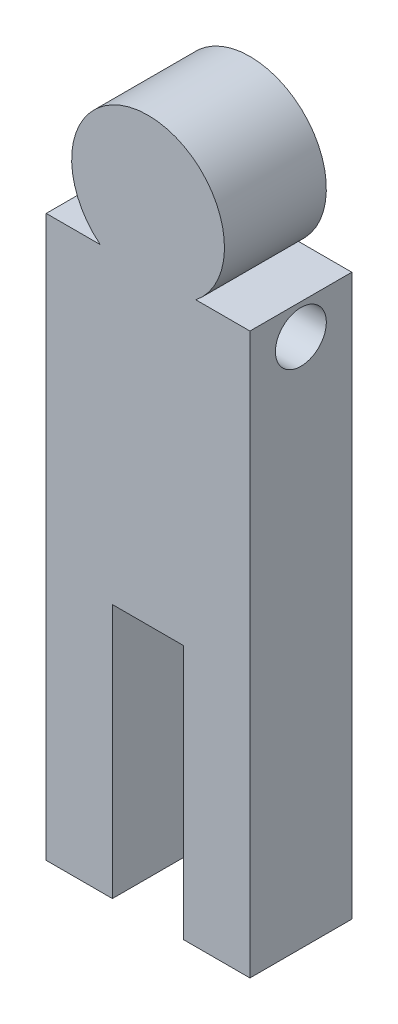
ISO-10303-21;
HEADER;
FILE_DESCRIPTION(('STEP AP214'),'2;1');
FILE_NAME('part.step','',(''),(''),'','','');
FILE_SCHEMA(('AUTOMOTIVE_DESIGN { 1 0 10303 214 1 1 1 1 }'));
ENDSEC;
DATA;
#1=APPLICATION_CONTEXT('core data for automotive mechanical design processes');
#2=APPLICATION_PROTOCOL_DEFINITION('international standard','automotive_design',2000,#1);
#3=PRODUCT_CONTEXT('',#1,'mechanical');
#4=PRODUCT('Part','Part','',(#3));
#5=PRODUCT_RELATED_PRODUCT_CATEGORY('part','',(#4));
#6=PRODUCT_DEFINITION_FORMATION('','',#4);
#7=PRODUCT_DEFINITION_CONTEXT('part definition',#1,'design');
#8=PRODUCT_DEFINITION('design','',#6,#7);
#9=PRODUCT_DEFINITION_SHAPE('','',#8);
#10=(LENGTH_UNIT() NAMED_UNIT(*) SI_UNIT(.MILLI.,.METRE.));
#11=(NAMED_UNIT(*) PLANE_ANGLE_UNIT() SI_UNIT($,.RADIAN.));
#12=(NAMED_UNIT(*) SI_UNIT($,.STERADIAN.) SOLID_ANGLE_UNIT());
#13=UNCERTAINTY_MEASURE_WITH_UNIT(LENGTH_MEASURE(1.E-05),#10,'distance_accuracy_value','');
#14=(GEOMETRIC_REPRESENTATION_CONTEXT(3) GLOBAL_UNCERTAINTY_ASSIGNED_CONTEXT((#13)) GLOBAL_UNIT_ASSIGNED_CONTEXT((#10,
#11,#12)) REPRESENTATION_CONTEXT('',''));
#15=CARTESIAN_POINT('',(0.,0.,0.));
#16=DIRECTION('',(0.,0.,1.));
#17=DIRECTION('',(1.,0.,0.));
#18=AXIS2_PLACEMENT_3D('',#15,#16,#17);
#19=CARTESIAN_POINT('',(4.69532415377732,15.,10.));
#20=DIRECTION('',(0.,-1.,0.));
#21=DIRECTION('',(0.,0.,-1.));
#22=AXIS2_PLACEMENT_3D('',#19,#20,#21);
#23=PLANE('',#22);
#24=DIRECTION('',(-1.,0.,0.));
#25=VECTOR('',#24,1.);
#26=CARTESIAN_POINT('',(4.69532415377732,15.,0.));
#27=LINE('',#26,#25);
#28=CARTESIAN_POINT('',(10.,15.,0.));
#29=VERTEX_POINT('',#28);
#30=CARTESIAN_POINT('',(4.69532415377732,15.,0.));
#31=VERTEX_POINT('',#30);
#32=EDGE_CURVE('E157',#29,#31,#27,.T.);
#33=ORIENTED_EDGE('',*,*,#32,.T.);
#34=DIRECTION('',(0.,0.,-1.));
#35=VECTOR('',#34,1.);
#36=CARTESIAN_POINT('',(4.69532415377732,15.,10.));
#37=LINE('',#36,#35);
#38=CARTESIAN_POINT('',(4.69532415377732,15.,10.));
#39=VERTEX_POINT('',#38);
#40=EDGE_CURVE('E11',#39,#31,#37,.T.);
#41=ORIENTED_EDGE('',*,*,#40,.F.);
#42=DIRECTION('',(-1.,0.,0.));
#43=VECTOR('',#42,1.);
#44=CARTESIAN_POINT('',(4.69532415377732,15.,10.));
#45=LINE('',#44,#43);
#46=CARTESIAN_POINT('',(10.,15.,10.));
#47=VERTEX_POINT('',#46);
#48=EDGE_CURVE('E188',#47,#39,#45,.T.);
#49=ORIENTED_EDGE('',*,*,#48,.F.);
#50=DIRECTION('',(0.,0.,-1.));
#51=VECTOR('',#50,1.);
#52=CARTESIAN_POINT('',(10.,15.,10.));
#53=LINE('',#52,#51);
#54=EDGE_CURVE('E153',#47,#29,#53,.T.);
#55=ORIENTED_EDGE('',*,*,#54,.T.);
#56=EDGE_LOOP('',(#33,#41,#49,#55));
#57=FACE_BOUND('',#56,.T.);
#58=ADVANCED_FACE('F43',(#57),#23,.F.);
#59=CARTESIAN_POINT('',(0.,20.8484126984127,10.));
#60=DIRECTION('',(0.,0.,-1.));
#61=DIRECTION('',(-1.,0.,0.));
#62=AXIS2_PLACEMENT_3D('',#59,#60,#61);
#63=CYLINDRICAL_SURFACE('',#62,7.5);
#64=CARTESIAN_POINT('',(0.,20.8484126984127,0.));
#65=DIRECTION('',(0.,0.,1.));
#66=DIRECTION('',(1.,0.,0.));
#67=AXIS2_PLACEMENT_3D('',#64,#65,#66);
#68=CIRCLE('',#67,7.5);
#69=CARTESIAN_POINT('',(-4.69532415377732,15.,0.));
#70=VERTEX_POINT('',#69);
#71=EDGE_CURVE('E161',#31,#70,#68,.T.);
#72=ORIENTED_EDGE('',*,*,#71,.T.);
#73=DIRECTION('',(0.,0.,-1.));
#74=VECTOR('',#73,1.);
#75=CARTESIAN_POINT('',(-4.69532415377732,15.,10.));
#76=LINE('',#75,#74);
#77=CARTESIAN_POINT('',(-4.69532415377732,15.,10.));
#78=VERTEX_POINT('',#77);
#79=EDGE_CURVE('E52',#78,#70,#76,.T.);
#80=ORIENTED_EDGE('',*,*,#79,.F.);
#81=CARTESIAN_POINT('',(0.,20.8484126984127,10.));
#82=DIRECTION('',(0.,0.,1.));
#83=DIRECTION('',(1.,0.,0.));
#84=AXIS2_PLACEMENT_3D('',#81,#82,#83);
#85=CIRCLE('',#84,7.5);
#86=EDGE_CURVE('E107',#39,#78,#85,.T.);
#87=ORIENTED_EDGE('',*,*,#86,.F.);
#88=ORIENTED_EDGE('',*,*,#40,.T.);
#89=EDGE_LOOP('',(#72,#80,#87,#88));
#90=FACE_BOUND('',#89,.T.);
#91=ADVANCED_FACE('F269',(#90),#63,.T.);
#92=CARTESIAN_POINT('',(-10.,15.,10.));
#93=DIRECTION('',(0.,-1.,0.));
#94=DIRECTION('',(0.,0.,-1.));
#95=AXIS2_PLACEMENT_3D('',#92,#93,#94);
#96=PLANE('',#95);
#97=DIRECTION('',(-1.,0.,0.));
#98=VECTOR('',#97,1.);
#99=CARTESIAN_POINT('',(-10.,15.,0.));
#100=LINE('',#99,#98);
#101=CARTESIAN_POINT('',(-10.,15.,0.));
#102=VERTEX_POINT('',#101);
#103=EDGE_CURVE('E165',#70,#102,#100,.T.);
#104=ORIENTED_EDGE('',*,*,#103,.T.);
#105=DIRECTION('',(0.,0.,-1.));
#106=VECTOR('',#105,1.);
#107=CARTESIAN_POINT('',(-10.,15.,10.));
#108=LINE('',#107,#106);
#109=CARTESIAN_POINT('',(-10.,15.,10.));
#110=VERTEX_POINT('',#109);
#111=EDGE_CURVE('E207',#110,#102,#108,.T.);
#112=ORIENTED_EDGE('',*,*,#111,.F.);
#113=DIRECTION('',(-1.,0.,0.));
#114=VECTOR('',#113,1.);
#115=CARTESIAN_POINT('',(-10.,15.,10.));
#116=LINE('',#115,#114);
#117=EDGE_CURVE('E217',#78,#110,#116,.T.);
#118=ORIENTED_EDGE('',*,*,#117,.F.);
#119=ORIENTED_EDGE('',*,*,#79,.T.);
#120=EDGE_LOOP('',(#104,#112,#118,#119));
#121=FACE_BOUND('',#120,.T.);
#122=ADVANCED_FACE('F215',(#121),#96,.F.);
#123=CARTESIAN_POINT('',(-10.,-15.,10.));
#124=DIRECTION('',(1.,0.,0.));
#125=DIRECTION('',(0.,1.,0.));
#126=AXIS2_PLACEMENT_3D('',#123,#124,#125);
#127=PLANE('',#126);
#128=CARTESIAN_POINT('',(-10.,12.,5.));
#129=DIRECTION('',(1.,0.,0.));
#130=DIRECTION('',(0.,1.,0.));
#131=AXIS2_PLACEMENT_3D('',#128,#129,#130);
#132=CIRCLE('',#131,2.5);
#133=CARTESIAN_POINT('',(-10.,14.5,5.));
#134=VERTEX_POINT('',#133);
#135=EDGE_CURVE('E162',#134,#134,#132,.T.);
#136=ORIENTED_EDGE('',*,*,#135,.T.);
#137=EDGE_LOOP('',(#136));
#138=FACE_BOUND('',#137,.T.);
#139=DIRECTION('',(0.,-1.,0.));
#140=VECTOR('',#139,1.);
#141=CARTESIAN_POINT('',(-10.,-15.,0.));
#142=LINE('',#141,#140);
#143=CARTESIAN_POINT('',(-9.99999999999999,-40.,0.));
#144=VERTEX_POINT('',#143);
#145=EDGE_CURVE('E169',#102,#144,#142,.T.);
#146=ORIENTED_EDGE('',*,*,#145,.T.);
#147=DIRECTION('',(0.,0.,-1.));
#148=VECTOR('',#147,1.);
#149=CARTESIAN_POINT('',(-9.99999999999999,-40.,10.));
#150=LINE('',#149,#148);
#151=CARTESIAN_POINT('',(-9.99999999999999,-40.,10.));
#152=VERTEX_POINT('',#151);
#153=EDGE_CURVE('E203',#152,#144,#150,.T.);
#154=ORIENTED_EDGE('',*,*,#153,.F.);
#155=DIRECTION('',(0.,-1.,0.));
#156=VECTOR('',#155,1.);
#157=CARTESIAN_POINT('',(-10.,-15.,10.));
#158=LINE('',#157,#156);
#159=EDGE_CURVE('E233',#110,#152,#158,.T.);
#160=ORIENTED_EDGE('',*,*,#159,.F.);
#161=ORIENTED_EDGE('',*,*,#111,.T.);
#162=EDGE_LOOP('',(#146,#154,#160,#161));
#163=FACE_BOUND('',#162,.T.);
#164=ADVANCED_FACE('F223',(#138,#163),#127,.F.);
#165=CARTESIAN_POINT('',(-9.99999999999999,-40.,10.));
#166=DIRECTION('',(0.,1.,0.));
#167=DIRECTION('',(0.,0.,1.));
#168=AXIS2_PLACEMENT_3D('',#165,#166,#167);
#169=PLANE('',#168);
#170=DIRECTION('',(1.,0.,0.));
#171=VECTOR('',#170,1.);
#172=CARTESIAN_POINT('',(-9.99999999999999,-40.,0.));
#173=LINE('',#172,#171);
#174=CARTESIAN_POINT('',(-3.5,-40.,0.));
#175=VERTEX_POINT('',#174);
#176=EDGE_CURVE('E172',#144,#175,#173,.T.);
#177=ORIENTED_EDGE('',*,*,#176,.T.);
#178=DIRECTION('',(0.,0.,-1.));
#179=VECTOR('',#178,1.);
#180=CARTESIAN_POINT('',(-3.5,-40.,10.));
#181=LINE('',#180,#179);
#182=CARTESIAN_POINT('',(-3.5,-40.,10.));
#183=VERTEX_POINT('',#182);
#184=EDGE_CURVE('E199',#183,#175,#181,.T.);
#185=ORIENTED_EDGE('',*,*,#184,.F.);
#186=DIRECTION('',(1.,0.,0.));
#187=VECTOR('',#186,1.);
#188=CARTESIAN_POINT('',(-9.99999999999999,-40.,10.));
#189=LINE('',#188,#187);
#190=EDGE_CURVE('E229',#152,#183,#189,.T.);
#191=ORIENTED_EDGE('',*,*,#190,.F.);
#192=ORIENTED_EDGE('',*,*,#153,.T.);
#193=EDGE_LOOP('',(#177,#185,#191,#192));
#194=FACE_BOUND('',#193,.T.);
#195=ADVANCED_FACE('F227',(#194),#169,.F.);
#196=CARTESIAN_POINT('',(-3.5,-40.,10.));
#197=DIRECTION('',(-1.,0.,0.));
#198=DIRECTION('',(0.,0.,1.));
#199=AXIS2_PLACEMENT_3D('',#196,#197,#198);
#200=PLANE('',#199);
#201=DIRECTION('',(0.,1.,0.));
#202=VECTOR('',#201,1.);
#203=CARTESIAN_POINT('',(-3.5,-40.,0.));
#204=LINE('',#203,#202);
#205=CARTESIAN_POINT('',(-3.5,-15.,0.));
#206=VERTEX_POINT('',#205);
#207=EDGE_CURVE('E175',#175,#206,#204,.T.);
#208=ORIENTED_EDGE('',*,*,#207,.T.);
#209=DIRECTION('',(0.,0.,-1.));
#210=VECTOR('',#209,1.);
#211=CARTESIAN_POINT('',(-3.5,-15.,10.));
#212=LINE('',#211,#210);
#213=CARTESIAN_POINT('',(-3.5,-15.,10.));
#214=VERTEX_POINT('',#213);
#215=EDGE_CURVE('E195',#214,#206,#212,.T.);
#216=ORIENTED_EDGE('',*,*,#215,.F.);
#217=DIRECTION('',(0.,1.,0.));
#218=VECTOR('',#217,1.);
#219=CARTESIAN_POINT('',(-3.5,-40.,10.));
#220=LINE('',#219,#218);
#221=EDGE_CURVE('E232',#183,#214,#220,.T.);
#222=ORIENTED_EDGE('',*,*,#221,.F.);
#223=ORIENTED_EDGE('',*,*,#184,.T.);
#224=EDGE_LOOP('',(#208,#216,#222,#223));
#225=FACE_BOUND('',#224,.T.);
#226=ADVANCED_FACE('F286',(#225),#200,.F.);
#227=CARTESIAN_POINT('',(-3.5,-15.,10.));
#228=DIRECTION('',(0.,1.,0.));
#229=DIRECTION('',(0.,0.,1.));
#230=AXIS2_PLACEMENT_3D('',#227,#228,#229);
#231=PLANE('',#230);
#232=DIRECTION('',(1.,0.,0.));
#233=VECTOR('',#232,1.);
#234=CARTESIAN_POINT('',(-3.5,-15.,0.));
#235=LINE('',#234,#233);
#236=CARTESIAN_POINT('',(3.5,-15.,0.));
#237=VERTEX_POINT('',#236);
#238=EDGE_CURVE('E178',#206,#237,#235,.T.);
#239=ORIENTED_EDGE('',*,*,#238,.T.);
#240=DIRECTION('',(0.,0.,-1.));
#241=VECTOR('',#240,1.);
#242=CARTESIAN_POINT('',(3.5,-15.,10.));
#243=LINE('',#242,#241);
#244=CARTESIAN_POINT('',(3.5,-15.,10.));
#245=VERTEX_POINT('',#244);
#246=EDGE_CURVE('E146',#245,#237,#243,.T.);
#247=ORIENTED_EDGE('',*,*,#246,.F.);
#248=DIRECTION('',(1.,0.,0.));
#249=VECTOR('',#248,1.);
#250=CARTESIAN_POINT('',(-3.5,-15.,10.));
#251=LINE('',#250,#249);
#252=EDGE_CURVE('E133',#214,#245,#251,.T.);
#253=ORIENTED_EDGE('',*,*,#252,.F.);
#254=ORIENTED_EDGE('',*,*,#215,.T.);
#255=EDGE_LOOP('',(#239,#247,#253,#254));
#256=FACE_BOUND('',#255,.T.);
#257=ADVANCED_FACE('F289',(#256),#231,.F.);
#258=CARTESIAN_POINT('',(3.5,-40.,10.));
#259=DIRECTION('',(1.,0.,0.));
#260=DIRECTION('',(0.,0.,-1.));
#261=AXIS2_PLACEMENT_3D('',#258,#259,#260);
#262=PLANE('',#261);
#263=DIRECTION('',(0.,-1.,0.));
#264=VECTOR('',#263,1.);
#265=CARTESIAN_POINT('',(3.5,-40.,0.));
#266=LINE('',#265,#264);
#267=CARTESIAN_POINT('',(3.5,-40.,0.));
#268=VERTEX_POINT('',#267);
#269=EDGE_CURVE('E143',#237,#268,#266,.T.);
#270=ORIENTED_EDGE('',*,*,#269,.T.);
#271=DIRECTION('',(0.,0.,-1.));
#272=VECTOR('',#271,1.);
#273=CARTESIAN_POINT('',(3.5,-40.,10.));
#274=LINE('',#273,#272);
#275=CARTESIAN_POINT('',(3.5,-40.,10.));
#276=VERTEX_POINT('',#275);
#277=EDGE_CURVE('E140',#276,#268,#274,.T.);
#278=ORIENTED_EDGE('',*,*,#277,.F.);
#279=DIRECTION('',(0.,-1.,0.));
#280=VECTOR('',#279,1.);
#281=CARTESIAN_POINT('',(3.5,-40.,10.));
#282=LINE('',#281,#280);
#283=EDGE_CURVE('E126',#245,#276,#282,.T.);
#284=ORIENTED_EDGE('',*,*,#283,.F.);
#285=ORIENTED_EDGE('',*,*,#246,.T.);
#286=EDGE_LOOP('',(#270,#278,#284,#285));
#287=FACE_BOUND('',#286,.T.);
#288=ADVANCED_FACE('F141',(#287),#262,.F.);
#289=CARTESIAN_POINT('',(10.,-40.,10.));
#290=DIRECTION('',(0.,1.,0.));
#291=DIRECTION('',(0.,0.,1.));
#292=AXIS2_PLACEMENT_3D('',#289,#290,#291);
#293=PLANE('',#292);
#294=DIRECTION('',(1.,0.,0.));
#295=VECTOR('',#294,1.);
#296=CARTESIAN_POINT('',(10.,-40.,0.));
#297=LINE('',#296,#295);
#298=CARTESIAN_POINT('',(10.,-40.,0.));
#299=VERTEX_POINT('',#298);
#300=EDGE_CURVE('E183',#268,#299,#297,.T.);
#301=ORIENTED_EDGE('',*,*,#300,.T.);
#302=DIRECTION('',(0.,0.,-1.));
#303=VECTOR('',#302,1.);
#304=CARTESIAN_POINT('',(10.,-40.,10.));
#305=LINE('',#304,#303);
#306=CARTESIAN_POINT('',(10.,-40.,10.));
#307=VERTEX_POINT('',#306);
#308=EDGE_CURVE('E147',#307,#299,#305,.T.);
#309=ORIENTED_EDGE('',*,*,#308,.F.);
#310=DIRECTION('',(1.,0.,0.));
#311=VECTOR('',#310,1.);
#312=CARTESIAN_POINT('',(10.,-40.,10.));
#313=LINE('',#312,#311);
#314=EDGE_CURVE('E130',#276,#307,#313,.T.);
#315=ORIENTED_EDGE('',*,*,#314,.F.);
#316=ORIENTED_EDGE('',*,*,#277,.T.);
#317=EDGE_LOOP('',(#301,#309,#315,#316));
#318=FACE_BOUND('',#317,.T.);
#319=ADVANCED_FACE('F149',(#318),#293,.F.);
#320=CARTESIAN_POINT('',(10.,-15.,10.));
#321=DIRECTION('',(-1.,0.,0.));
#322=DIRECTION('',(0.,0.,1.));
#323=AXIS2_PLACEMENT_3D('',#320,#321,#322);
#324=PLANE('',#323);
#325=CARTESIAN_POINT('',(10.,12.,5.));
#326=DIRECTION('',(1.,0.,0.));
#327=DIRECTION('',(0.,0.,-1.));
#328=AXIS2_PLACEMENT_3D('',#325,#326,#327);
#329=CIRCLE('',#328,2.5);
#330=CARTESIAN_POINT('',(10.,12.,2.5));
#331=VERTEX_POINT('',#330);
#332=EDGE_CURVE('E250',#331,#331,#329,.T.);
#333=ORIENTED_EDGE('',*,*,#332,.F.);
#334=EDGE_LOOP('',(#333));
#335=FACE_BOUND('',#334,.T.);
#336=DIRECTION('',(0.,1.,0.));
#337=VECTOR('',#336,1.);
#338=CARTESIAN_POINT('',(10.,-15.,0.));
#339=LINE('',#338,#337);
#340=EDGE_CURVE('E95',#299,#29,#339,.T.);
#341=ORIENTED_EDGE('',*,*,#340,.T.);
#342=ORIENTED_EDGE('',*,*,#54,.F.);
#343=DIRECTION('',(0.,1.,0.));
#344=VECTOR('',#343,1.);
#345=CARTESIAN_POINT('',(10.,-15.,10.));
#346=LINE('',#345,#344);
#347=EDGE_CURVE('E60',#307,#47,#346,.T.);
#348=ORIENTED_EDGE('',*,*,#347,.F.);
#349=ORIENTED_EDGE('',*,*,#308,.T.);
#350=EDGE_LOOP('',(#341,#342,#348,#349));
#351=FACE_BOUND('',#350,.T.);
#352=ADVANCED_FACE('F258',(#335,#351),#324,.F.);
#353=CARTESIAN_POINT('',(0.,20.8484126984127,10.));
#354=DIRECTION('',(0.,0.,1.));
#355=DIRECTION('',(1.,0.,0.));
#356=AXIS2_PLACEMENT_3D('',#353,#354,#355);
#357=PLANE('',#356);
#358=ORIENTED_EDGE('',*,*,#48,.T.);
#359=ORIENTED_EDGE('',*,*,#86,.T.);
#360=ORIENTED_EDGE('',*,*,#117,.T.);
#361=ORIENTED_EDGE('',*,*,#159,.T.);
#362=ORIENTED_EDGE('',*,*,#190,.T.);
#363=ORIENTED_EDGE('',*,*,#221,.T.);
#364=ORIENTED_EDGE('',*,*,#252,.T.);
#365=ORIENTED_EDGE('',*,*,#283,.T.);
#366=ORIENTED_EDGE('',*,*,#314,.T.);
#367=ORIENTED_EDGE('',*,*,#347,.T.);
#368=EDGE_LOOP('',(#358,#359,#360,#361,#362,#363,#364,#365,#366,#367));
#369=FACE_BOUND('',#368,.T.);
#370=ADVANCED_FACE('F128',(#369),#357,.T.);
#371=CARTESIAN_POINT('',(0.,20.8484126984127,0.));
#372=DIRECTION('',(0.,0.,1.));
#373=DIRECTION('',(1.,0.,0.));
#374=AXIS2_PLACEMENT_3D('',#371,#372,#373);
#375=PLANE('',#374);
#376=ORIENTED_EDGE('',*,*,#32,.F.);
#377=ORIENTED_EDGE('',*,*,#340,.F.);
#378=ORIENTED_EDGE('',*,*,#300,.F.);
#379=ORIENTED_EDGE('',*,*,#269,.F.);
#380=ORIENTED_EDGE('',*,*,#238,.F.);
#381=ORIENTED_EDGE('',*,*,#207,.F.);
#382=ORIENTED_EDGE('',*,*,#176,.F.);
#383=ORIENTED_EDGE('',*,*,#145,.F.);
#384=ORIENTED_EDGE('',*,*,#103,.F.);
#385=ORIENTED_EDGE('',*,*,#71,.F.);
#386=EDGE_LOOP('',(#376,#377,#378,#379,#380,#381,#382,#383,#384,#385));
#387=FACE_BOUND('',#386,.T.);
#388=ADVANCED_FACE('F218',(#387),#375,.F.);
#389=CARTESIAN_POINT('',(-11.,12.,5.));
#390=DIRECTION('',(1.,0.,0.));
#391=DIRECTION('',(0.,0.,-1.));
#392=AXIS2_PLACEMENT_3D('',#389,#390,#391);
#393=CYLINDRICAL_SURFACE('',#392,2.5);
#394=ORIENTED_EDGE('',*,*,#332,.T.);
#395=EDGE_LOOP('',(#394));
#396=FACE_BOUND('',#395,.T.);
#397=ORIENTED_EDGE('',*,*,#135,.F.);
#398=EDGE_LOOP('',(#397));
#399=FACE_BOUND('',#398,.T.);
#400=ADVANCED_FACE('F255',(#396,#399),#393,.F.);
#401=CLOSED_SHELL('',(#58,#91,#122,#164,#195,#226,#257,#288,#319,#352,#370,#388,#400));
#402=MANIFOLD_SOLID_BREP('B2',#401);
#403=ADVANCED_BREP_SHAPE_REPRESENTATION('',(#18,#402),#14);
#404=SHAPE_DEFINITION_REPRESENTATION(#9,#403);
ENDSEC;
END-ISO-10303-21;
